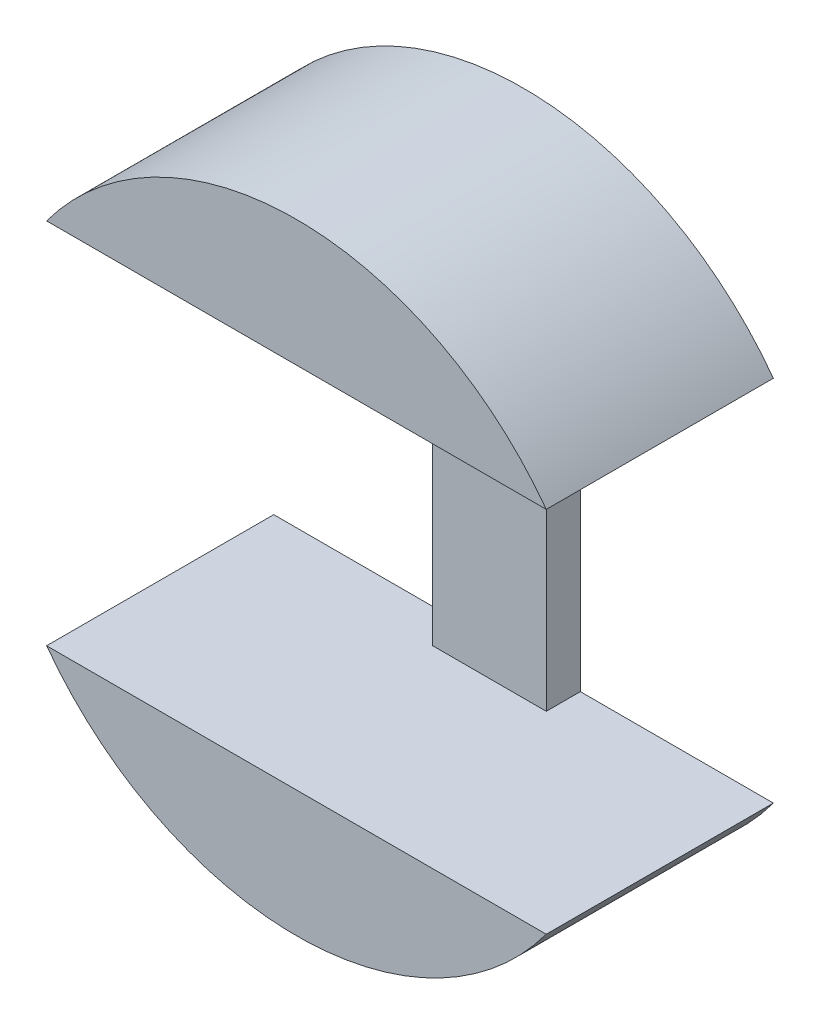
ISO-10303-21;
HEADER;
FILE_DESCRIPTION(('STEP AP214'),'2;1');
FILE_NAME('part.step','',(''),(''),'','','');
FILE_SCHEMA(('AUTOMOTIVE_DESIGN { 1 0 10303 214 1 1 1 1 }'));
ENDSEC;
DATA;
#1=APPLICATION_CONTEXT('core data for automotive mechanical design processes');
#2=APPLICATION_PROTOCOL_DEFINITION('international standard','automotive_design',2000,#1);
#3=PRODUCT_CONTEXT('',#1,'mechanical');
#4=PRODUCT('Part','Part','',(#3));
#5=PRODUCT_RELATED_PRODUCT_CATEGORY('part','',(#4));
#6=PRODUCT_DEFINITION_FORMATION('','',#4);
#7=PRODUCT_DEFINITION_CONTEXT('part definition',#1,'design');
#8=PRODUCT_DEFINITION('design','',#6,#7);
#9=PRODUCT_DEFINITION_SHAPE('','',#8);
#10=(LENGTH_UNIT() NAMED_UNIT(*) SI_UNIT(.MILLI.,.METRE.));
#11=(NAMED_UNIT(*) PLANE_ANGLE_UNIT() SI_UNIT($,.RADIAN.));
#12=(NAMED_UNIT(*) SI_UNIT($,.STERADIAN.) SOLID_ANGLE_UNIT());
#13=UNCERTAINTY_MEASURE_WITH_UNIT(LENGTH_MEASURE(1.E-05),#10,'distance_accuracy_value','');
#14=(GEOMETRIC_REPRESENTATION_CONTEXT(3) GLOBAL_UNCERTAINTY_ASSIGNED_CONTEXT((#13)) GLOBAL_UNIT_ASSIGNED_CONTEXT((#10,
#11,#12)) REPRESENTATION_CONTEXT('',''));
#15=CARTESIAN_POINT('',(0.,0.,0.));
#16=DIRECTION('',(0.,0.,1.));
#17=DIRECTION('',(1.,0.,0.));
#18=AXIS2_PLACEMENT_3D('',#15,#16,#17);
#19=CARTESIAN_POINT('',(0.,0.,10.));
#20=DIRECTION('',(0.,0.,-1.));
#21=DIRECTION('',(-1.,0.,0.));
#22=AXIS2_PLACEMENT_3D('',#19,#20,#21);
#23=PLANE('',#22);
#24=CARTESIAN_POINT('',(0.,0.,10.));
#25=DIRECTION('',(0.,0.,1.));
#26=DIRECTION('',(-1.,0.,0.));
#27=AXIS2_PLACEMENT_3D('',#24,#25,#26);
#28=CIRCLE('',#27,13.6605270762149);
#29=CARTESIAN_POINT('',(-11.,-8.1,10.));
#30=VERTEX_POINT('',#29);
#31=CARTESIAN_POINT('',(11.,-8.1,10.));
#32=VERTEX_POINT('',#31);
#33=EDGE_CURVE('E133',#30,#32,#28,.T.);
#34=ORIENTED_EDGE('',*,*,#33,.T.);
#35=DIRECTION('',(-1.,0.,0.));
#36=VECTOR('',#35,1.);
#37=CARTESIAN_POINT('',(-2.5,-8.1,10.));
#38=LINE('',#37,#36);
#39=EDGE_CURVE('E55',#32,#30,#38,.T.);
#40=ORIENTED_EDGE('',*,*,#39,.T.);
#41=EDGE_LOOP('',(#34,#40));
#42=FACE_BOUND('',#41,.T.);
#43=ADVANCED_FACE('F38',(#42),#23,.F.);
#44=CARTESIAN_POINT('',(0.,0.,10.));
#45=DIRECTION('',(0.,0.,-1.));
#46=DIRECTION('',(-1.,0.,0.));
#47=AXIS2_PLACEMENT_3D('',#44,#45,#46);
#48=CYLINDRICAL_SURFACE('',#47,13.6605270762149);
#49=CARTESIAN_POINT('',(0.,0.,0.));
#50=DIRECTION('',(0.,0.,1.));
#51=DIRECTION('',(-1.,0.,0.));
#52=AXIS2_PLACEMENT_3D('',#49,#50,#51);
#53=CIRCLE('',#52,13.6605270762149);
#54=CARTESIAN_POINT('',(11.,8.1,0.));
#55=VERTEX_POINT('',#54);
#56=CARTESIAN_POINT('',(-11.,8.1,0.));
#57=VERTEX_POINT('',#56);
#58=EDGE_CURVE('E154',#55,#57,#53,.T.);
#59=ORIENTED_EDGE('',*,*,#58,.T.);
#60=DIRECTION('',(0.,0.,-1.));
#61=VECTOR('',#60,1.);
#62=CARTESIAN_POINT('',(-11.,8.1,10.));
#63=LINE('',#62,#61);
#64=CARTESIAN_POINT('',(-11.,8.1,10.));
#65=VERTEX_POINT('',#64);
#66=EDGE_CURVE('E47',#65,#57,#63,.T.);
#67=ORIENTED_EDGE('',*,*,#66,.F.);
#68=CARTESIAN_POINT('',(0.,0.,10.));
#69=DIRECTION('',(0.,0.,1.));
#70=DIRECTION('',(-1.,0.,0.));
#71=AXIS2_PLACEMENT_3D('',#68,#69,#70);
#72=CIRCLE('',#71,13.6605270762149);
#73=CARTESIAN_POINT('',(11.,8.1,10.));
#74=VERTEX_POINT('',#73);
#75=EDGE_CURVE('E99',#74,#65,#72,.T.);
#76=ORIENTED_EDGE('',*,*,#75,.F.);
#77=DIRECTION('',(0.,0.,-1.));
#78=VECTOR('',#77,1.);
#79=CARTESIAN_POINT('',(11.,8.1,10.));
#80=LINE('',#79,#78);
#81=EDGE_CURVE('E12',#74,#55,#80,.T.);
#82=ORIENTED_EDGE('',*,*,#81,.T.);
#83=EDGE_LOOP('',(#59,#67,#76,#82));
#84=FACE_BOUND('',#83,.T.);
#85=ADVANCED_FACE('F40',(#84),#48,.T.);
#86=CARTESIAN_POINT('',(-2.5,8.1,10.));
#87=DIRECTION('',(0.,1.,0.));
#88=DIRECTION('',(-1.,0.,0.));
#89=AXIS2_PLACEMENT_3D('',#86,#87,#88);
#90=PLANE('',#89);
#91=DIRECTION('',(1.,0.,0.));
#92=VECTOR('',#91,1.);
#93=CARTESIAN_POINT('',(-2.5,8.1,0.));
#94=LINE('',#93,#92);
#95=CARTESIAN_POINT('',(-2.5,8.1,0.));
#96=VERTEX_POINT('',#95);
#97=EDGE_CURVE('E147',#57,#96,#94,.T.);
#98=ORIENTED_EDGE('',*,*,#97,.T.);
#99=DIRECTION('',(0.,0.,-1.));
#100=VECTOR('',#99,1.);
#101=CARTESIAN_POINT('',(-2.5,8.1,10.));
#102=LINE('',#101,#100);
#103=CARTESIAN_POINT('',(-2.5,8.1,1.5));
#104=VERTEX_POINT('',#103);
#105=EDGE_CURVE('E141',#104,#96,#102,.T.);
#106=ORIENTED_EDGE('',*,*,#105,.F.);
#107=DIRECTION('',(-1.,0.,0.));
#108=VECTOR('',#107,1.);
#109=CARTESIAN_POINT('',(2.5,8.1,1.5));
#110=LINE('',#109,#108);
#111=CARTESIAN_POINT('',(2.5,8.1,1.5));
#112=VERTEX_POINT('',#111);
#113=EDGE_CURVE('E123',#112,#104,#110,.T.);
#114=ORIENTED_EDGE('',*,*,#113,.F.);
#115=DIRECTION('',(0.,0.,-1.));
#116=VECTOR('',#115,1.);
#117=CARTESIAN_POINT('',(2.5,8.1,10.));
#118=LINE('',#117,#116);
#119=CARTESIAN_POINT('',(2.5,8.1,0.));
#120=VERTEX_POINT('',#119);
#121=EDGE_CURVE('E93',#112,#120,#118,.T.);
#122=ORIENTED_EDGE('',*,*,#121,.T.);
#123=DIRECTION('',(1.,0.,0.));
#124=VECTOR('',#123,1.);
#125=CARTESIAN_POINT('',(2.5,8.1,0.));
#126=LINE('',#125,#124);
#127=EDGE_CURVE('E161',#120,#55,#126,.T.);
#128=ORIENTED_EDGE('',*,*,#127,.T.);
#129=ORIENTED_EDGE('',*,*,#81,.F.);
#130=DIRECTION('',(1.,0.,0.));
#131=VECTOR('',#130,1.);
#132=CARTESIAN_POINT('',(2.5,8.1,10.));
#133=LINE('',#132,#131);
#134=EDGE_CURVE('E150',#65,#74,#133,.T.);
#135=ORIENTED_EDGE('',*,*,#134,.F.);
#136=ORIENTED_EDGE('',*,*,#66,.T.);
#137=EDGE_LOOP('',(#98,#106,#114,#122,#128,#129,#135,#136));
#138=FACE_BOUND('',#137,.T.);
#139=ADVANCED_FACE('F145',(#138),#90,.F.);
#140=CARTESIAN_POINT('',(-2.5,-8.1,10.));
#141=DIRECTION('',(1.,0.,0.));
#142=DIRECTION('',(0.,0.,-1.));
#143=AXIS2_PLACEMENT_3D('',#140,#141,#142);
#144=PLANE('',#143);
#145=DIRECTION('',(0.,0.,-1.));
#146=VECTOR('',#145,1.);
#147=CARTESIAN_POINT('',(-2.5,-8.1,10.));
#148=LINE('',#147,#146);
#149=CARTESIAN_POINT('',(-2.5,-8.1,1.5));
#150=VERTEX_POINT('',#149);
#151=CARTESIAN_POINT('',(-2.5,-8.1,0.));
#152=VERTEX_POINT('',#151);
#153=EDGE_CURVE('E139',#150,#152,#148,.T.);
#154=ORIENTED_EDGE('',*,*,#153,.F.);
#155=DIRECTION('',(0.,-1.,0.));
#156=VECTOR('',#155,1.);
#157=CARTESIAN_POINT('',(-2.5,-8.1,1.5));
#158=LINE('',#157,#156);
#159=EDGE_CURVE('E119',#104,#150,#158,.T.);
#160=ORIENTED_EDGE('',*,*,#159,.F.);
#161=ORIENTED_EDGE('',*,*,#105,.T.);
#162=DIRECTION('',(0.,-1.,0.));
#163=VECTOR('',#162,1.);
#164=CARTESIAN_POINT('',(-2.5,-8.1,0.));
#165=LINE('',#164,#163);
#166=EDGE_CURVE('E157',#96,#152,#165,.T.);
#167=ORIENTED_EDGE('',*,*,#166,.T.);
#168=EDGE_LOOP('',(#154,#160,#161,#167));
#169=FACE_BOUND('',#168,.T.);
#170=ADVANCED_FACE('F177',(#169),#144,.F.);
#171=CARTESIAN_POINT('',(0.,0.,10.));
#172=DIRECTION('',(0.,0.,-1.));
#173=DIRECTION('',(-1.,0.,0.));
#174=AXIS2_PLACEMENT_3D('',#171,#172,#173);
#175=CYLINDRICAL_SURFACE('',#174,13.6605270762149);
#176=CARTESIAN_POINT('',(0.,0.,0.));
#177=DIRECTION('',(0.,0.,1.));
#178=DIRECTION('',(-1.,0.,0.));
#179=AXIS2_PLACEMENT_3D('',#176,#177,#178);
#180=CIRCLE('',#179,13.6605270762149);
#181=CARTESIAN_POINT('',(-11.,-8.1,0.));
#182=VERTEX_POINT('',#181);
#183=CARTESIAN_POINT('',(11.,-8.1,0.));
#184=VERTEX_POINT('',#183);
#185=EDGE_CURVE('E166',#182,#184,#180,.T.);
#186=ORIENTED_EDGE('',*,*,#185,.T.);
#187=DIRECTION('',(0.,0.,-1.));
#188=VECTOR('',#187,1.);
#189=CARTESIAN_POINT('',(11.,-8.1,10.));
#190=LINE('',#189,#188);
#191=EDGE_CURVE('E129',#32,#184,#190,.T.);
#192=ORIENTED_EDGE('',*,*,#191,.F.);
#193=ORIENTED_EDGE('',*,*,#33,.F.);
#194=DIRECTION('',(0.,0.,-1.));
#195=VECTOR('',#194,1.);
#196=CARTESIAN_POINT('',(-11.,-8.1,10.));
#197=LINE('',#196,#195);
#198=EDGE_CURVE('E131',#30,#182,#197,.T.);
#199=ORIENTED_EDGE('',*,*,#198,.T.);
#200=EDGE_LOOP('',(#186,#192,#193,#199));
#201=FACE_BOUND('',#200,.T.);
#202=ADVANCED_FACE('F181',(#201),#175,.T.);
#203=CARTESIAN_POINT('',(2.5,-8.1,10.));
#204=DIRECTION('',(0.,-1.,0.));
#205=DIRECTION('',(0.,0.,-1.));
#206=AXIS2_PLACEMENT_3D('',#203,#204,#205);
#207=PLANE('',#206);
#208=DIRECTION('',(-1.,0.,0.));
#209=VECTOR('',#208,1.);
#210=CARTESIAN_POINT('',(2.5,-8.1,0.));
#211=LINE('',#210,#209);
#212=CARTESIAN_POINT('',(2.5,-8.1,0.));
#213=VERTEX_POINT('',#212);
#214=EDGE_CURVE('E127',#184,#213,#211,.T.);
#215=ORIENTED_EDGE('',*,*,#214,.T.);
#216=DIRECTION('',(0.,0.,-1.));
#217=VECTOR('',#216,1.);
#218=CARTESIAN_POINT('',(2.5,-8.1,10.));
#219=LINE('',#218,#217);
#220=CARTESIAN_POINT('',(2.5,-8.1,1.5));
#221=VERTEX_POINT('',#220);
#222=EDGE_CURVE('E85',#221,#213,#219,.T.);
#223=ORIENTED_EDGE('',*,*,#222,.F.);
#224=DIRECTION('',(1.,0.,0.));
#225=VECTOR('',#224,1.);
#226=CARTESIAN_POINT('',(2.5,-8.1,1.5));
#227=LINE('',#226,#225);
#228=EDGE_CURVE('E115',#150,#221,#227,.T.);
#229=ORIENTED_EDGE('',*,*,#228,.F.);
#230=ORIENTED_EDGE('',*,*,#153,.T.);
#231=DIRECTION('',(-1.,0.,0.));
#232=VECTOR('',#231,1.);
#233=CARTESIAN_POINT('',(-2.5,-8.1,0.));
#234=LINE('',#233,#232);
#235=EDGE_CURVE('E159',#152,#182,#234,.T.);
#236=ORIENTED_EDGE('',*,*,#235,.T.);
#237=ORIENTED_EDGE('',*,*,#198,.F.);
#238=ORIENTED_EDGE('',*,*,#39,.F.);
#239=ORIENTED_EDGE('',*,*,#191,.T.);
#240=EDGE_LOOP('',(#215,#223,#229,#230,#236,#237,#238,#239));
#241=FACE_BOUND('',#240,.T.);
#242=ADVANCED_FACE('F125',(#241),#207,.F.);
#243=CARTESIAN_POINT('',(2.5,-8.1,10.));
#244=DIRECTION('',(-1.,0.,0.));
#245=DIRECTION('',(0.,0.,1.));
#246=AXIS2_PLACEMENT_3D('',#243,#244,#245);
#247=PLANE('',#246);
#248=ORIENTED_EDGE('',*,*,#121,.F.);
#249=DIRECTION('',(0.,1.,0.));
#250=VECTOR('',#249,1.);
#251=CARTESIAN_POINT('',(2.5,-8.1,1.5));
#252=LINE('',#251,#250);
#253=EDGE_CURVE('E117',#221,#112,#252,.T.);
#254=ORIENTED_EDGE('',*,*,#253,.F.);
#255=ORIENTED_EDGE('',*,*,#222,.T.);
#256=DIRECTION('',(0.,1.,0.));
#257=VECTOR('',#256,1.);
#258=CARTESIAN_POINT('',(2.5,-8.1,0.));
#259=LINE('',#258,#257);
#260=EDGE_CURVE('E168',#213,#120,#259,.T.);
#261=ORIENTED_EDGE('',*,*,#260,.T.);
#262=EDGE_LOOP('',(#248,#254,#255,#261));
#263=FACE_BOUND('',#262,.T.);
#264=ADVANCED_FACE('F122',(#263),#247,.F.);
#265=ORIENTED_EDGE('',*,*,#75,.T.);
#266=ORIENTED_EDGE('',*,*,#134,.T.);
#267=EDGE_LOOP('',(#265,#266));
#268=FACE_BOUND('',#267,.T.);
#269=ADVANCED_FACE('F186',(#268),#23,.F.);
#270=CARTESIAN_POINT('',(0.,0.,0.));
#271=DIRECTION('',(0.,0.,-1.));
#272=DIRECTION('',(-1.,0.,0.));
#273=AXIS2_PLACEMENT_3D('',#270,#271,#272);
#274=PLANE('',#273);
#275=ORIENTED_EDGE('',*,*,#127,.F.);
#276=ORIENTED_EDGE('',*,*,#260,.F.);
#277=ORIENTED_EDGE('',*,*,#214,.F.);
#278=ORIENTED_EDGE('',*,*,#185,.F.);
#279=ORIENTED_EDGE('',*,*,#235,.F.);
#280=ORIENTED_EDGE('',*,*,#166,.F.);
#281=ORIENTED_EDGE('',*,*,#97,.F.);
#282=ORIENTED_EDGE('',*,*,#58,.F.);
#283=EDGE_LOOP('',(#275,#276,#277,#278,#279,#280,#281,#282));
#284=FACE_BOUND('',#283,.T.);
#285=ADVANCED_FACE('F153',(#284),#274,.T.);
#286=CARTESIAN_POINT('',(0.,0.,1.5));
#287=DIRECTION('',(0.,0.,-1.));
#288=DIRECTION('',(-1.,0.,0.));
#289=AXIS2_PLACEMENT_3D('',#286,#287,#288);
#290=PLANE('',#289);
#291=ORIENTED_EDGE('',*,*,#159,.T.);
#292=ORIENTED_EDGE('',*,*,#228,.T.);
#293=ORIENTED_EDGE('',*,*,#253,.T.);
#294=ORIENTED_EDGE('',*,*,#113,.T.);
#295=EDGE_LOOP('',(#291,#292,#293,#294));
#296=FACE_BOUND('',#295,.T.);
#297=ADVANCED_FACE('F116',(#296),#290,.F.);
#298=CLOSED_SHELL('',(#43,#85,#139,#170,#202,#242,#264,#269,#285,#297));
#299=MANIFOLD_SOLID_BREP('B2',#298);
#300=ADVANCED_BREP_SHAPE_REPRESENTATION('',(#18,#299),#14);
#301=SHAPE_DEFINITION_REPRESENTATION(#9,#300);
ENDSEC;
END-ISO-10303-21;
